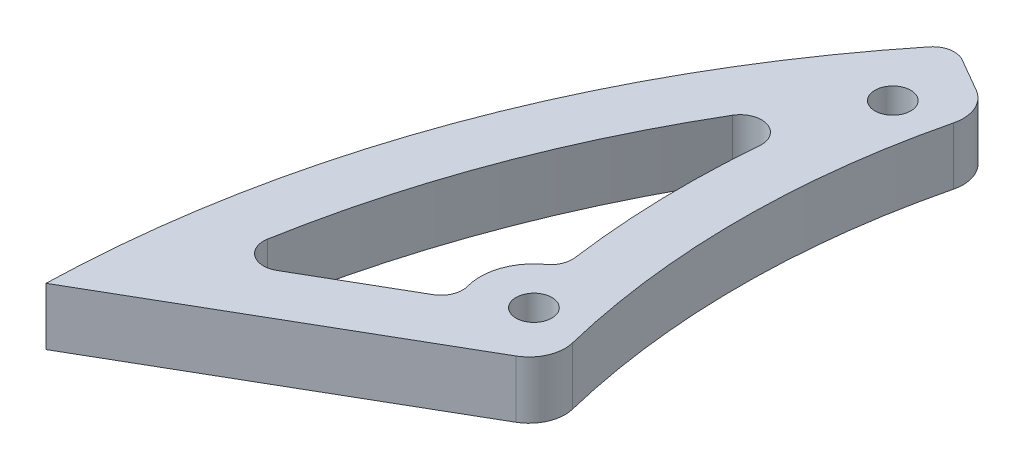
ISO-10303-21;
HEADER;
FILE_DESCRIPTION(('STEP AP214'),'2;1');
FILE_NAME('part.step','',(''),(''),'','','');
FILE_SCHEMA(('AUTOMOTIVE_DESIGN { 1 0 10303 214 1 1 1 1 }'));
ENDSEC;
DATA;
#1=APPLICATION_CONTEXT('core data for automotive mechanical design processes');
#2=APPLICATION_PROTOCOL_DEFINITION('international standard','automotive_design',2000,#1);
#3=PRODUCT_CONTEXT('',#1,'mechanical');
#4=PRODUCT('Part','Part','',(#3));
#5=PRODUCT_RELATED_PRODUCT_CATEGORY('part','',(#4));
#6=PRODUCT_DEFINITION_FORMATION('','',#4);
#7=PRODUCT_DEFINITION_CONTEXT('part definition',#1,'design');
#8=PRODUCT_DEFINITION('design','',#6,#7);
#9=PRODUCT_DEFINITION_SHAPE('','',#8);
#10=(LENGTH_UNIT() NAMED_UNIT(*) SI_UNIT(.MILLI.,.METRE.));
#11=(NAMED_UNIT(*) PLANE_ANGLE_UNIT() SI_UNIT($,.RADIAN.));
#12=(NAMED_UNIT(*) SI_UNIT($,.STERADIAN.) SOLID_ANGLE_UNIT());
#13=UNCERTAINTY_MEASURE_WITH_UNIT(LENGTH_MEASURE(1.E-05),#10,'distance_accuracy_value','');
#14=(GEOMETRIC_REPRESENTATION_CONTEXT(3) GLOBAL_UNCERTAINTY_ASSIGNED_CONTEXT((#13)) GLOBAL_UNIT_ASSIGNED_CONTEXT((#10,
#11,#12)) REPRESENTATION_CONTEXT('',''));
#15=CARTESIAN_POINT('',(0.,0.,0.));
#16=DIRECTION('',(0.,0.,1.));
#17=DIRECTION('',(1.,0.,0.));
#18=AXIS2_PLACEMENT_3D('',#15,#16,#17);
#19=CARTESIAN_POINT('',(0.,4.,0.));
#20=DIRECTION('',(0.,1.,0.));
#21=DIRECTION('',(0.,0.,1.));
#22=AXIS2_PLACEMENT_3D('',#19,#20,#21);
#23=PLANE('',#22);
#24=DIRECTION('',(-0.866025403784439,0.,-0.5));
#25=VECTOR('',#24,1.);
#26=CARTESIAN_POINT('',(-13.805005031535,4.,23.9109701133626));
#27=LINE('',#26,#25);
#28=CARTESIAN_POINT('',(-110.754014478588,4.,-32.0625665885613));
#29=VERTEX_POINT('',#28);
#30=CARTESIAN_POINT('',(-115.419321295632,4.,-34.7560827352334));
#31=VERTEX_POINT('',#30);
#32=EDGE_CURVE('E199',#29,#31,#27,.T.);
#33=ORIENTED_EDGE('',*,*,#32,.T.);
#34=CARTESIAN_POINT('',(-116.919321295632,4.,-32.1580065238801));
#35=DIRECTION('',(0.,1.,0.));
#36=DIRECTION('',(0.,0.,1.));
#37=AXIS2_PLACEMENT_3D('',#34,#35,#36);
#38=CIRCLE('',#37,3.);
#39=CARTESIAN_POINT('',(-119.258108415678,4.,-34.0368558544826));
#40=VERTEX_POINT('',#39);
#41=EDGE_CURVE('E297',#31,#40,#38,.T.);
#42=ORIENTED_EDGE('',*,*,#41,.T.);
#43=CARTESIAN_POINT('',(-2.31875241336388,4.,59.9056106756444));
#44=DIRECTION('',(0.,1.,0.));
#45=DIRECTION('',(0.,0.,1.));
#46=AXIS2_PLACEMENT_3D('',#43,#44,#45);
#47=CIRCLE('',#46,150.);
#48=CARTESIAN_POINT('',(-152.268704204241,4.,56.0310838769909));
#49=VERTEX_POINT('',#48);
#50=EDGE_CURVE('E204',#40,#49,#47,.T.);
#51=ORIENTED_EDGE('',*,*,#50,.T.);
#52=DIRECTION('',(-0.866025403784438,0.,0.500000000000002));
#53=VECTOR('',#52,1.);
#54=CARTESIAN_POINT('',(-13.8050050315352,4.,-23.9109701133628));
#55=LINE('',#54,#53);
#56=CARTESIAN_POINT('',(-110.754014478588,4.,32.0625665885613));
#57=VERTEX_POINT('',#56);
#58=EDGE_CURVE('E207',#57,#49,#55,.T.);
#59=ORIENTED_EDGE('',*,*,#58,.F.);
#60=CARTESIAN_POINT('',(-113.254014478588,4.,27.7324395696391));
#61=DIRECTION('',(0.,1.,0.));
#62=DIRECTION('',(0.,0.,1.));
#63=AXIS2_PLACEMENT_3D('',#60,#61,#62);
#64=CIRCLE('',#63,5.);
#65=CARTESIAN_POINT('',(-108.397495847431,4.,26.5432268951262));
#66=VERTEX_POINT('',#65);
#67=EDGE_CURVE('E280',#57,#66,#64,.T.);
#68=ORIENTED_EDGE('',*,*,#67,.T.);
#69=CARTESIAN_POINT('',(0.,4.,0.));
#70=DIRECTION('',(0.,1.,0.));
#71=DIRECTION('',(0.,0.,1.));
#72=AXIS2_PLACEMENT_3D('',#69,#70,#71);
#73=CIRCLE('',#72,111.6);
#74=CARTESIAN_POINT('',(-108.397495847431,4.,-26.5432268951262));
#75=VERTEX_POINT('',#74);
#76=EDGE_CURVE('E195',#75,#66,#73,.T.);
#77=ORIENTED_EDGE('',*,*,#76,.F.);
#78=CARTESIAN_POINT('',(-113.254014478588,4.,-27.7324395696391));
#79=DIRECTION('',(0.,1.,0.));
#80=DIRECTION('',(0.,0.,1.));
#81=AXIS2_PLACEMENT_3D('',#78,#79,#80);
#82=CIRCLE('',#81,5.);
#83=EDGE_CURVE('E277',#75,#29,#82,.T.);
#84=ORIENTED_EDGE('',*,*,#83,.T.);
#85=EDGE_LOOP('',(#33,#42,#51,#59,#68,#77,#84));
#86=FACE_BOUND('',#85,.T.);
#87=CARTESIAN_POINT('',(-115.321290315362,4.,25.));
#88=DIRECTION('',(0.,1.,0.));
#89=DIRECTION('',(0.,0.,1.));
#90=AXIS2_PLACEMENT_3D('',#87,#88,#89);
#91=CIRCLE('',#90,2.5);
#92=CARTESIAN_POINT('',(-115.321290315362,4.,27.5));
#93=VERTEX_POINT('',#92);
#94=EDGE_CURVE('E211',#93,#93,#91,.T.);
#95=ORIENTED_EDGE('',*,*,#94,.F.);
#96=EDGE_LOOP('',(#95));
#97=FACE_BOUND('',#96,.T.);
#98=CARTESIAN_POINT('',(-115.321290315362,4.,-25.));
#99=DIRECTION('',(0.,1.,0.));
#100=DIRECTION('',(0.,0.,1.));
#101=AXIS2_PLACEMENT_3D('',#98,#99,#100);
#102=CIRCLE('',#101,2.5);
#103=CARTESIAN_POINT('',(-115.321290315362,4.,-22.5));
#104=VERTEX_POINT('',#103);
#105=EDGE_CURVE('E215',#104,#104,#102,.T.);
#106=ORIENTED_EDGE('',*,*,#105,.F.);
#107=EDGE_LOOP('',(#106));
#108=FACE_BOUND('',#107,.T.);
#109=CARTESIAN_POINT('',(-2.31875241336388,4.,59.9056106756444));
#110=DIRECTION('',(0.,1.,0.));
#111=DIRECTION('',(0.,0.,1.));
#112=AXIS2_PLACEMENT_3D('',#109,#110,#111);
#113=CIRCLE('',#112,142.);
#114=CARTESIAN_POINT('',(-124.732425155548,4.,-12.0589134023306));
#115=VERTEX_POINT('',#114);
#116=CARTESIAN_POINT('',(-142.165402677388,4.,35.2699777442207));
#117=VERTEX_POINT('',#116);
#118=EDGE_CURVE('E182',#115,#117,#113,.T.);
#119=ORIENTED_EDGE('',*,*,#118,.F.);
#120=CARTESIAN_POINT('',(-122.14622080184,4.,-10.5385361330776));
#121=DIRECTION('',(0.,1.,0.));
#122=DIRECTION('',(0.,0.,1.));
#123=AXIS2_PLACEMENT_3D('',#120,#121,#122);
#124=CIRCLE('',#123,3.);
#125=CARTESIAN_POINT('',(-119.15732469739,4.,-10.2806600449925));
#126=VERTEX_POINT('',#125);
#127=EDGE_CURVE('E160',#115,#126,#124,.F.);
#128=ORIENTED_EDGE('',*,*,#127,.T.);
#129=CARTESIAN_POINT('',(0.,4.,0.));
#130=DIRECTION('',(0.,1.,0.));
#131=DIRECTION('',(0.,0.,1.));
#132=AXIS2_PLACEMENT_3D('',#129,#130,#131);
#133=CIRCLE('',#132,119.6);
#134=CARTESIAN_POINT('',(-118.511997397868,4.,16.0955420153478));
#135=VERTEX_POINT('',#134);
#136=EDGE_CURVE('E173',#126,#135,#133,.T.);
#137=ORIENTED_EDGE('',*,*,#136,.T.);
#138=CARTESIAN_POINT('',(-121.484706362697,4.,16.4992763468364));
#139=DIRECTION('',(0.,1.,0.));
#140=DIRECTION('',(0.,0.,1.));
#141=AXIS2_PLACEMENT_3D('',#138,#139,#140);
#142=CIRCLE('',#141,3.);
#143=CARTESIAN_POINT('',(-119.723730349173,4.,18.9280545334546));
#144=VERTEX_POINT('',#143);
#145=EDGE_CURVE('E56',#135,#144,#142,.F.);
#146=ORIENTED_EDGE('',*,*,#145,.T.);
#147=CARTESIAN_POINT('',(-115.321290315362,4.,25.));
#148=DIRECTION('',(0.,1.,0.));
#149=DIRECTION('',(0.,0.,1.));
#150=AXIS2_PLACEMENT_3D('',#147,#148,#149);
#151=CIRCLE('',#150,7.50000000000001);
#152=CARTESIAN_POINT('',(-122.542775640224,4.,27.0248826392678));
#153=VERTEX_POINT('',#152);
#154=EDGE_CURVE('E178',#144,#153,#151,.T.);
#155=ORIENTED_EDGE('',*,*,#154,.T.);
#156=CARTESIAN_POINT('',(-125.431369770168,4.,27.8348356949749));
#157=DIRECTION('',(0.,1.,0.));
#158=DIRECTION('',(0.,0.,1.));
#159=AXIS2_PLACEMENT_3D('',#156,#157,#158);
#160=CIRCLE('',#159,3.);
#161=CARTESIAN_POINT('',(-123.931369770168,4.,30.4329119063282));
#162=VERTEX_POINT('',#161);
#163=EDGE_CURVE('E63',#153,#162,#160,.F.);
#164=ORIENTED_EDGE('',*,*,#163,.T.);
#165=DIRECTION('',(0.866025403784438,0.,-0.500000000000001));
#166=VECTOR('',#165,1.);
#167=CARTESIAN_POINT('',(-17.8050050315352,4.,-30.8391733436383));
#168=LINE('',#167,#166);
#169=CARTESIAN_POINT('',(-137.710895981669,4.,38.3885250738435));
#170=VERTEX_POINT('',#169);
#171=EDGE_CURVE('E186',#170,#162,#168,.T.);
#172=ORIENTED_EDGE('',*,*,#171,.F.);
#173=CARTESIAN_POINT('',(-139.210895981669,4.,35.7904488624902));
#174=DIRECTION('',(0.,1.,0.));
#175=DIRECTION('',(0.,0.,1.));
#176=AXIS2_PLACEMENT_3D('',#173,#174,#175);
#177=CIRCLE('',#176,3.);
#178=EDGE_CURVE('E71',#170,#117,#177,.F.);
#179=ORIENTED_EDGE('',*,*,#178,.T.);
#180=EDGE_LOOP('',(#119,#128,#137,#146,#155,#164,#172,#179));
#181=FACE_BOUND('',#180,.T.);
#182=ADVANCED_FACE('F47',(#86,#97,#108,#181),#23,.T.);
#183=CARTESIAN_POINT('',(0.,-4.,0.));
#184=DIRECTION('',(0.,1.,0.));
#185=DIRECTION('',(0.,0.,1.));
#186=AXIS2_PLACEMENT_3D('',#183,#184,#185);
#187=PLANE('',#186);
#188=CARTESIAN_POINT('',(-115.321290315362,-4.,-25.));
#189=DIRECTION('',(0.,1.,0.));
#190=DIRECTION('',(0.,0.,1.));
#191=AXIS2_PLACEMENT_3D('',#188,#189,#190);
#192=CIRCLE('',#191,2.5);
#193=CARTESIAN_POINT('',(-115.321290315362,-4.,-22.5));
#194=VERTEX_POINT('',#193);
#195=EDGE_CURVE('E200',#194,#194,#192,.T.);
#196=ORIENTED_EDGE('',*,*,#195,.T.);
#197=EDGE_LOOP('',(#196));
#198=FACE_BOUND('',#197,.T.);
#199=CARTESIAN_POINT('',(-115.321290315362,-4.,25.));
#200=DIRECTION('',(0.,1.,0.));
#201=DIRECTION('',(0.,0.,1.));
#202=AXIS2_PLACEMENT_3D('',#199,#200,#201);
#203=CIRCLE('',#202,2.5);
#204=CARTESIAN_POINT('',(-115.321290315362,-4.,27.5));
#205=VERTEX_POINT('',#204);
#206=EDGE_CURVE('E234',#205,#205,#203,.T.);
#207=ORIENTED_EDGE('',*,*,#206,.T.);
#208=EDGE_LOOP('',(#207));
#209=FACE_BOUND('',#208,.T.);
#210=CARTESIAN_POINT('',(-2.31875241336388,-4.,59.9056106756444));
#211=DIRECTION('',(0.,1.,0.));
#212=DIRECTION('',(0.,0.,1.));
#213=AXIS2_PLACEMENT_3D('',#210,#211,#212);
#214=CIRCLE('',#213,150.);
#215=CARTESIAN_POINT('',(-119.258108415678,-4.,-34.0368558544826));
#216=VERTEX_POINT('',#215);
#217=CARTESIAN_POINT('',(-152.268704204241,-4.,56.0310838769909));
#218=VERTEX_POINT('',#217);
#219=EDGE_CURVE('E227',#216,#218,#214,.T.);
#220=ORIENTED_EDGE('',*,*,#219,.F.);
#221=CARTESIAN_POINT('',(-116.919321295632,-4.,-32.1580065238801));
#222=DIRECTION('',(0.,1.,0.));
#223=DIRECTION('',(0.,0.,1.));
#224=AXIS2_PLACEMENT_3D('',#221,#222,#223);
#225=CIRCLE('',#224,3.);
#226=CARTESIAN_POINT('',(-115.419321295632,-4.,-34.7560827352334));
#227=VERTEX_POINT('',#226);
#228=EDGE_CURVE('E291',#216,#227,#225,.F.);
#229=ORIENTED_EDGE('',*,*,#228,.T.);
#230=DIRECTION('',(-0.866025403784439,0.,-0.5));
#231=VECTOR('',#230,1.);
#232=CARTESIAN_POINT('',(-13.805005031535,-4.,23.9109701133626));
#233=LINE('',#232,#231);
#234=CARTESIAN_POINT('',(-110.754014478588,-4.,-32.0625665885613));
#235=VERTEX_POINT('',#234);
#236=EDGE_CURVE('E223',#235,#227,#233,.T.);
#237=ORIENTED_EDGE('',*,*,#236,.F.);
#238=CARTESIAN_POINT('',(-113.254014478588,-4.,-27.7324395696391));
#239=DIRECTION('',(0.,1.,0.));
#240=DIRECTION('',(0.,0.,1.));
#241=AXIS2_PLACEMENT_3D('',#238,#239,#240);
#242=CIRCLE('',#241,5.);
#243=CARTESIAN_POINT('',(-108.397495847431,-4.,-26.5432268951262));
#244=VERTEX_POINT('',#243);
#245=EDGE_CURVE('E268',#235,#244,#242,.F.);
#246=ORIENTED_EDGE('',*,*,#245,.T.);
#247=CARTESIAN_POINT('',(0.,-4.,0.));
#248=DIRECTION('',(0.,1.,0.));
#249=DIRECTION('',(0.,0.,1.));
#250=AXIS2_PLACEMENT_3D('',#247,#248,#249);
#251=CIRCLE('',#250,111.6);
#252=CARTESIAN_POINT('',(-108.397495847431,-4.,26.5432268951262));
#253=VERTEX_POINT('',#252);
#254=EDGE_CURVE('E168',#244,#253,#251,.T.);
#255=ORIENTED_EDGE('',*,*,#254,.T.);
#256=CARTESIAN_POINT('',(-113.254014478588,-4.,27.7324395696391));
#257=DIRECTION('',(0.,1.,0.));
#258=DIRECTION('',(0.,0.,1.));
#259=AXIS2_PLACEMENT_3D('',#256,#257,#258);
#260=CIRCLE('',#259,5.);
#261=CARTESIAN_POINT('',(-110.754014478588,-4.,32.0625665885613));
#262=VERTEX_POINT('',#261);
#263=EDGE_CURVE('E271',#253,#262,#260,.F.);
#264=ORIENTED_EDGE('',*,*,#263,.T.);
#265=DIRECTION('',(-0.866025403784438,0.,0.500000000000002));
#266=VECTOR('',#265,1.);
#267=CARTESIAN_POINT('',(-13.8050050315352,-4.,-23.9109701133628));
#268=LINE('',#267,#266);
#269=EDGE_CURVE('E230',#262,#218,#268,.T.);
#270=ORIENTED_EDGE('',*,*,#269,.T.);
#271=EDGE_LOOP('',(#220,#229,#237,#246,#255,#264,#270));
#272=FACE_BOUND('',#271,.T.);
#273=CARTESIAN_POINT('',(-122.14622080184,-4.,-10.5385361330776));
#274=DIRECTION('',(0.,1.,0.));
#275=DIRECTION('',(0.,0.,1.));
#276=AXIS2_PLACEMENT_3D('',#273,#274,#275);
#277=CIRCLE('',#276,3.);
#278=CARTESIAN_POINT('',(-124.732425155548,-4.,-12.0589134023306));
#279=VERTEX_POINT('',#278);
#280=CARTESIAN_POINT('',(-119.15732469739,-4.,-10.2806600449925));
#281=VERTEX_POINT('',#280);
#282=EDGE_CURVE('E163',#279,#281,#277,.F.);
#283=ORIENTED_EDGE('',*,*,#282,.F.);
#284=CARTESIAN_POINT('',(-2.31875241336388,-4.,59.9056106756444));
#285=DIRECTION('',(0.,1.,0.));
#286=DIRECTION('',(0.,0.,1.));
#287=AXIS2_PLACEMENT_3D('',#284,#285,#286);
#288=CIRCLE('',#287,142.);
#289=CARTESIAN_POINT('',(-142.165402677388,-4.,35.2699777442207));
#290=VERTEX_POINT('',#289);
#291=EDGE_CURVE('E244',#279,#290,#288,.T.);
#292=ORIENTED_EDGE('',*,*,#291,.T.);
#293=CARTESIAN_POINT('',(-139.210895981669,-4.,35.7904488624902));
#294=DIRECTION('',(0.,1.,0.));
#295=DIRECTION('',(0.,0.,1.));
#296=AXIS2_PLACEMENT_3D('',#293,#294,#295);
#297=CIRCLE('',#296,3.);
#298=CARTESIAN_POINT('',(-137.710895981669,-4.,38.3885250738435));
#299=VERTEX_POINT('',#298);
#300=EDGE_CURVE('E325',#290,#299,#297,.T.);
#301=ORIENTED_EDGE('',*,*,#300,.T.);
#302=DIRECTION('',(0.866025403784438,0.,-0.500000000000001));
#303=VECTOR('',#302,1.);
#304=CARTESIAN_POINT('',(-17.8050050315352,-4.,-30.8391733436383));
#305=LINE('',#304,#303);
#306=CARTESIAN_POINT('',(-123.931369770168,-4.,30.4329119063282));
#307=VERTEX_POINT('',#306);
#308=EDGE_CURVE('E248',#299,#307,#305,.T.);
#309=ORIENTED_EDGE('',*,*,#308,.T.);
#310=CARTESIAN_POINT('',(-125.431369770168,-4.,27.8348356949749));
#311=DIRECTION('',(0.,1.,0.));
#312=DIRECTION('',(0.,0.,1.));
#313=AXIS2_PLACEMENT_3D('',#310,#311,#312);
#314=CIRCLE('',#313,3.);
#315=CARTESIAN_POINT('',(-122.542775640224,-4.,27.0248826392678));
#316=VERTEX_POINT('',#315);
#317=EDGE_CURVE('E320',#307,#316,#314,.T.);
#318=ORIENTED_EDGE('',*,*,#317,.T.);
#319=CARTESIAN_POINT('',(-115.321290315362,-4.,25.));
#320=DIRECTION('',(0.,1.,0.));
#321=DIRECTION('',(0.,0.,1.));
#322=AXIS2_PLACEMENT_3D('',#319,#320,#321);
#323=CIRCLE('',#322,7.50000000000001);
#324=CARTESIAN_POINT('',(-119.723730349173,-4.,18.9280545334546));
#325=VERTEX_POINT('',#324);
#326=EDGE_CURVE('E252',#325,#316,#323,.T.);
#327=ORIENTED_EDGE('',*,*,#326,.F.);
#328=CARTESIAN_POINT('',(-121.484706362697,-4.,16.4992763468364));
#329=DIRECTION('',(0.,1.,0.));
#330=DIRECTION('',(0.,0.,1.));
#331=AXIS2_PLACEMENT_3D('',#328,#329,#330);
#332=CIRCLE('',#331,3.);
#333=CARTESIAN_POINT('',(-118.511997397868,-4.,16.0955420153478));
#334=VERTEX_POINT('',#333);
#335=EDGE_CURVE('E11',#325,#334,#332,.T.);
#336=ORIENTED_EDGE('',*,*,#335,.T.);
#337=CARTESIAN_POINT('',(0.,-4.,0.));
#338=DIRECTION('',(0.,1.,0.));
#339=DIRECTION('',(0.,0.,1.));
#340=AXIS2_PLACEMENT_3D('',#337,#338,#339);
#341=CIRCLE('',#340,119.6);
#342=EDGE_CURVE('E256',#281,#334,#341,.T.);
#343=ORIENTED_EDGE('',*,*,#342,.F.);
#344=EDGE_LOOP('',(#283,#292,#301,#309,#318,#327,#336,#343));
#345=FACE_BOUND('',#344,.T.);
#346=ADVANCED_FACE('F337',(#198,#209,#272,#345),#187,.F.);
#347=CARTESIAN_POINT('',(0.,4.,0.));
#348=DIRECTION('',(0.,-1.,0.));
#349=DIRECTION('',(0.,0.,-1.));
#350=AXIS2_PLACEMENT_3D('',#347,#348,#349);
#351=CYLINDRICAL_SURFACE('',#350,111.6);
#352=ORIENTED_EDGE('',*,*,#76,.T.);
#353=DIRECTION('',(0.,-1.,0.));
#354=VECTOR('',#353,1.);
#355=CARTESIAN_POINT('',(-108.397495847431,4.,26.5432268951262));
#356=LINE('',#355,#354);
#357=EDGE_CURVE('E264',#66,#253,#356,.T.);
#358=ORIENTED_EDGE('',*,*,#357,.T.);
#359=ORIENTED_EDGE('',*,*,#254,.F.);
#360=DIRECTION('',(0.,-1.,0.));
#361=VECTOR('',#360,1.);
#362=CARTESIAN_POINT('',(-108.397495847431,4.,-26.5432268951262));
#363=LINE('',#362,#361);
#364=EDGE_CURVE('E261',#244,#75,#363,.F.);
#365=ORIENTED_EDGE('',*,*,#364,.T.);
#366=EDGE_LOOP('',(#352,#358,#359,#365));
#367=FACE_BOUND('',#366,.T.);
#368=ADVANCED_FACE('F369',(#367),#351,.F.);
#369=CARTESIAN_POINT('',(-13.805005031535,4.,23.9109701133626));
#370=DIRECTION('',(-0.5,0.,0.866025403784439));
#371=DIRECTION('',(0.866025403784439,0.,0.5));
#372=AXIS2_PLACEMENT_3D('',#369,#370,#371);
#373=PLANE('',#372);
#374=ORIENTED_EDGE('',*,*,#236,.T.);
#375=DIRECTION('',(0.,-1.,0.));
#376=VECTOR('',#375,1.);
#377=CARTESIAN_POINT('',(-115.419321295632,4.,-34.7560827352334));
#378=LINE('',#377,#376);
#379=EDGE_CURVE('E294',#227,#31,#378,.F.);
#380=ORIENTED_EDGE('',*,*,#379,.T.);
#381=ORIENTED_EDGE('',*,*,#32,.F.);
#382=DIRECTION('',(0.,1.,0.));
#383=VECTOR('',#382,1.);
#384=CARTESIAN_POINT('',(-110.754014478588,-4.,-32.0625665885613));
#385=LINE('',#384,#383);
#386=EDGE_CURVE('E283',#29,#235,#385,.F.);
#387=ORIENTED_EDGE('',*,*,#386,.T.);
#388=EDGE_LOOP('',(#374,#380,#381,#387));
#389=FACE_BOUND('',#388,.T.);
#390=ADVANCED_FACE('F389',(#389),#373,.F.);
#391=CARTESIAN_POINT('',(-2.31875241336388,4.,59.9056106756444));
#392=DIRECTION('',(0.,-1.,0.));
#393=DIRECTION('',(0.,0.,-1.));
#394=AXIS2_PLACEMENT_3D('',#391,#392,#393);
#395=CYLINDRICAL_SURFACE('',#394,150.);
#396=ORIENTED_EDGE('',*,*,#50,.F.);
#397=DIRECTION('',(0.,-1.,0.));
#398=VECTOR('',#397,1.);
#399=CARTESIAN_POINT('',(-119.258108415678,4.,-34.0368558544826));
#400=LINE('',#399,#398);
#401=EDGE_CURVE('E287',#40,#216,#400,.T.);
#402=ORIENTED_EDGE('',*,*,#401,.T.);
#403=ORIENTED_EDGE('',*,*,#219,.T.);
#404=DIRECTION('',(0.,-1.,0.));
#405=VECTOR('',#404,1.);
#406=CARTESIAN_POINT('',(-152.268704204241,4.,56.0310838769909));
#407=LINE('',#406,#405);
#408=EDGE_CURVE('E219',#49,#218,#407,.T.);
#409=ORIENTED_EDGE('',*,*,#408,.F.);
#410=EDGE_LOOP('',(#396,#402,#403,#409));
#411=FACE_BOUND('',#410,.T.);
#412=ADVANCED_FACE('F382',(#411),#395,.T.);
#413=CARTESIAN_POINT('',(-115.321290315362,4.,25.));
#414=DIRECTION('',(0.,-1.,0.));
#415=DIRECTION('',(0.,0.,-1.));
#416=AXIS2_PLACEMENT_3D('',#413,#414,#415);
#417=CYLINDRICAL_SURFACE('',#416,2.5);
#418=ORIENTED_EDGE('',*,*,#94,.T.);
#419=EDGE_LOOP('',(#418));
#420=FACE_BOUND('',#419,.T.);
#421=ORIENTED_EDGE('',*,*,#206,.F.);
#422=EDGE_LOOP('',(#421));
#423=FACE_BOUND('',#422,.T.);
#424=ADVANCED_FACE('F379',(#420,#423),#417,.F.);
#425=CARTESIAN_POINT('',(-13.8050050315352,4.,-23.9109701133628));
#426=DIRECTION('',(0.500000000000002,0.,0.866025403784438));
#427=DIRECTION('',(0.866025403784438,0.,-0.500000000000002));
#428=AXIS2_PLACEMENT_3D('',#425,#426,#427);
#429=PLANE('',#428);
#430=ORIENTED_EDGE('',*,*,#269,.F.);
#431=DIRECTION('',(0.,-1.,0.));
#432=VECTOR('',#431,1.);
#433=CARTESIAN_POINT('',(-110.754014478588,4.,32.0625665885613));
#434=LINE('',#433,#432);
#435=EDGE_CURVE('E274',#262,#57,#434,.F.);
#436=ORIENTED_EDGE('',*,*,#435,.T.);
#437=ORIENTED_EDGE('',*,*,#58,.T.);
#438=ORIENTED_EDGE('',*,*,#408,.T.);
#439=EDGE_LOOP('',(#430,#436,#437,#438));
#440=FACE_BOUND('',#439,.T.);
#441=ADVANCED_FACE('F377',(#440),#429,.T.);
#442=CARTESIAN_POINT('',(-115.321290315362,4.,-25.));
#443=DIRECTION('',(0.,-1.,0.));
#444=DIRECTION('',(0.,0.,-1.));
#445=AXIS2_PLACEMENT_3D('',#442,#443,#444);
#446=CYLINDRICAL_SURFACE('',#445,2.5);
#447=ORIENTED_EDGE('',*,*,#105,.T.);
#448=EDGE_LOOP('',(#447));
#449=FACE_BOUND('',#448,.T.);
#450=ORIENTED_EDGE('',*,*,#195,.F.);
#451=EDGE_LOOP('',(#450));
#452=FACE_BOUND('',#451,.T.);
#453=ADVANCED_FACE('F374',(#449,#452),#446,.F.);
#454=CARTESIAN_POINT('',(-122.14622080184,-17.,-10.5385361330776));
#455=DIRECTION('',(0.,1.,0.));
#456=DIRECTION('',(0.,0.,1.));
#457=AXIS2_PLACEMENT_3D('',#454,#455,#456);
#458=CYLINDRICAL_SURFACE('',#457,3.);
#459=ORIENTED_EDGE('',*,*,#282,.T.);
#460=DIRECTION('',(0.,1.,0.));
#461=VECTOR('',#460,1.);
#462=CARTESIAN_POINT('',(-119.15732469739,-17.,-10.2806600449925));
#463=LINE('',#462,#461);
#464=EDGE_CURVE('E155',#281,#126,#463,.T.);
#465=ORIENTED_EDGE('',*,*,#464,.T.);
#466=ORIENTED_EDGE('',*,*,#127,.F.);
#467=DIRECTION('',(0.,1.,0.));
#468=VECTOR('',#467,1.);
#469=CARTESIAN_POINT('',(-124.732425155548,-17.,-12.0589134023306));
#470=LINE('',#469,#468);
#471=EDGE_CURVE('E169',#279,#115,#470,.T.);
#472=ORIENTED_EDGE('',*,*,#471,.F.);
#473=EDGE_LOOP('',(#459,#465,#466,#472));
#474=FACE_BOUND('',#473,.T.);
#475=ADVANCED_FACE('F157',(#474),#458,.F.);
#476=CARTESIAN_POINT('',(0.,-17.,0.));
#477=DIRECTION('',(0.,1.,0.));
#478=DIRECTION('',(0.,0.,1.));
#479=AXIS2_PLACEMENT_3D('',#476,#477,#478);
#480=CYLINDRICAL_SURFACE('',#479,119.6);
#481=ORIENTED_EDGE('',*,*,#342,.T.);
#482=DIRECTION('',(0.,1.,0.));
#483=VECTOR('',#482,1.);
#484=CARTESIAN_POINT('',(-118.511997397868,-17.,16.0955420153478));
#485=LINE('',#484,#483);
#486=EDGE_CURVE('E176',#334,#135,#485,.T.);
#487=ORIENTED_EDGE('',*,*,#486,.T.);
#488=ORIENTED_EDGE('',*,*,#136,.F.);
#489=ORIENTED_EDGE('',*,*,#464,.F.);
#490=EDGE_LOOP('',(#481,#487,#488,#489));
#491=FACE_BOUND('',#490,.T.);
#492=ADVANCED_FACE('F174',(#491),#480,.T.);
#493=CARTESIAN_POINT('',(-115.321290315362,-17.,25.));
#494=DIRECTION('',(0.,1.,0.));
#495=DIRECTION('',(0.,0.,1.));
#496=AXIS2_PLACEMENT_3D('',#493,#494,#495);
#497=CYLINDRICAL_SURFACE('',#496,7.50000000000001);
#498=ORIENTED_EDGE('',*,*,#326,.T.);
#499=DIRECTION('',(0.,1.,0.));
#500=VECTOR('',#499,1.);
#501=CARTESIAN_POINT('',(-122.542775640224,-17.,27.0248826392678));
#502=LINE('',#501,#500);
#503=EDGE_CURVE('E303',#316,#153,#502,.T.);
#504=ORIENTED_EDGE('',*,*,#503,.T.);
#505=ORIENTED_EDGE('',*,*,#154,.F.);
#506=DIRECTION('',(0.,1.,0.));
#507=VECTOR('',#506,1.);
#508=CARTESIAN_POINT('',(-119.723730349173,-17.,18.9280545334546));
#509=LINE('',#508,#507);
#510=EDGE_CURVE('E300',#144,#325,#509,.F.);
#511=ORIENTED_EDGE('',*,*,#510,.T.);
#512=EDGE_LOOP('',(#498,#504,#505,#511));
#513=FACE_BOUND('',#512,.T.);
#514=ADVANCED_FACE('F332',(#513),#497,.T.);
#515=CARTESIAN_POINT('',(-17.8050050315352,-17.,-30.8391733436383));
#516=DIRECTION('',(0.500000000000001,0.,0.866025403784438));
#517=DIRECTION('',(0.866025403784438,0.,-0.500000000000001));
#518=AXIS2_PLACEMENT_3D('',#515,#516,#517);
#519=PLANE('',#518);
#520=ORIENTED_EDGE('',*,*,#171,.T.);
#521=DIRECTION('',(0.,1.,0.));
#522=VECTOR('',#521,1.);
#523=CARTESIAN_POINT('',(-123.931369770168,-17.,30.4329119063282));
#524=LINE('',#523,#522);
#525=EDGE_CURVE('E310',#162,#307,#524,.F.);
#526=ORIENTED_EDGE('',*,*,#525,.T.);
#527=ORIENTED_EDGE('',*,*,#308,.F.);
#528=DIRECTION('',(0.,-1.,0.));
#529=VECTOR('',#528,1.);
#530=CARTESIAN_POINT('',(-137.710895981669,3.99999999999999,38.3885250738435));
#531=LINE('',#530,#529);
#532=EDGE_CURVE('E307',#299,#170,#531,.F.);
#533=ORIENTED_EDGE('',*,*,#532,.T.);
#534=EDGE_LOOP('',(#520,#526,#527,#533));
#535=FACE_BOUND('',#534,.T.);
#536=ADVANCED_FACE('F344',(#535),#519,.F.);
#537=CARTESIAN_POINT('',(-2.31875241336388,-17.,59.9056106756444));
#538=DIRECTION('',(0.,1.,0.));
#539=DIRECTION('',(0.,0.,1.));
#540=AXIS2_PLACEMENT_3D('',#537,#538,#539);
#541=CYLINDRICAL_SURFACE('',#540,142.);
#542=ORIENTED_EDGE('',*,*,#118,.T.);
#543=DIRECTION('',(0.,1.,0.));
#544=VECTOR('',#543,1.);
#545=CARTESIAN_POINT('',(-142.165402677388,-17.,35.2699777442207));
#546=LINE('',#545,#544);
#547=EDGE_CURVE('E313',#117,#290,#546,.F.);
#548=ORIENTED_EDGE('',*,*,#547,.T.);
#549=ORIENTED_EDGE('',*,*,#291,.F.);
#550=ORIENTED_EDGE('',*,*,#471,.T.);
#551=EDGE_LOOP('',(#542,#548,#549,#550));
#552=FACE_BOUND('',#551,.T.);
#553=ADVANCED_FACE('F348',(#552),#541,.F.);
#554=CARTESIAN_POINT('',(-113.254014478588,4.,27.7324395696391));
#555=DIRECTION('',(0.,-1.,0.));
#556=DIRECTION('',(0.,0.,-1.));
#557=AXIS2_PLACEMENT_3D('',#554,#555,#556);
#558=CYLINDRICAL_SURFACE('',#557,5.);
#559=ORIENTED_EDGE('',*,*,#67,.F.);
#560=ORIENTED_EDGE('',*,*,#435,.F.);
#561=ORIENTED_EDGE('',*,*,#263,.F.);
#562=ORIENTED_EDGE('',*,*,#357,.F.);
#563=EDGE_LOOP('',(#559,#560,#561,#562));
#564=FACE_BOUND('',#563,.T.);
#565=ADVANCED_FACE('F350',(#564),#558,.T.);
#566=CARTESIAN_POINT('',(-113.254014478588,4.,-27.7324395696391));
#567=DIRECTION('',(0.,-1.,0.));
#568=DIRECTION('',(0.,0.,-1.));
#569=AXIS2_PLACEMENT_3D('',#566,#567,#568);
#570=CYLINDRICAL_SURFACE('',#569,5.);
#571=ORIENTED_EDGE('',*,*,#83,.F.);
#572=ORIENTED_EDGE('',*,*,#364,.F.);
#573=ORIENTED_EDGE('',*,*,#245,.F.);
#574=ORIENTED_EDGE('',*,*,#386,.F.);
#575=EDGE_LOOP('',(#571,#572,#573,#574));
#576=FACE_BOUND('',#575,.T.);
#577=ADVANCED_FACE('F357',(#576),#570,.T.);
#578=CARTESIAN_POINT('',(-116.919321295632,4.,-32.1580065238801));
#579=DIRECTION('',(0.,-1.,0.));
#580=DIRECTION('',(0.,0.,-1.));
#581=AXIS2_PLACEMENT_3D('',#578,#579,#580);
#582=CYLINDRICAL_SURFACE('',#581,3.);
#583=ORIENTED_EDGE('',*,*,#41,.F.);
#584=ORIENTED_EDGE('',*,*,#379,.F.);
#585=ORIENTED_EDGE('',*,*,#228,.F.);
#586=ORIENTED_EDGE('',*,*,#401,.F.);
#587=EDGE_LOOP('',(#583,#584,#585,#586));
#588=FACE_BOUND('',#587,.T.);
#589=ADVANCED_FACE('F399',(#588),#582,.T.);
#590=CARTESIAN_POINT('',(-125.431369770168,-17.,27.8348356949749));
#591=DIRECTION('',(0.,1.,0.));
#592=DIRECTION('',(0.,0.,1.));
#593=AXIS2_PLACEMENT_3D('',#590,#591,#592);
#594=CYLINDRICAL_SURFACE('',#593,3.);
#595=ORIENTED_EDGE('',*,*,#317,.F.);
#596=ORIENTED_EDGE('',*,*,#525,.F.);
#597=ORIENTED_EDGE('',*,*,#163,.F.);
#598=ORIENTED_EDGE('',*,*,#503,.F.);
#599=EDGE_LOOP('',(#595,#596,#597,#598));
#600=FACE_BOUND('',#599,.T.);
#601=ADVANCED_FACE('F340',(#600),#594,.F.);
#602=CARTESIAN_POINT('',(-139.210895981669,-17.,35.7904488624902));
#603=DIRECTION('',(0.,1.,0.));
#604=DIRECTION('',(0.,0.,1.));
#605=AXIS2_PLACEMENT_3D('',#602,#603,#604);
#606=CYLINDRICAL_SURFACE('',#605,3.);
#607=ORIENTED_EDGE('',*,*,#300,.F.);
#608=ORIENTED_EDGE('',*,*,#547,.F.);
#609=ORIENTED_EDGE('',*,*,#178,.F.);
#610=ORIENTED_EDGE('',*,*,#532,.F.);
#611=EDGE_LOOP('',(#607,#608,#609,#610));
#612=FACE_BOUND('',#611,.T.);
#613=ADVANCED_FACE('F346',(#612),#606,.F.);
#614=CARTESIAN_POINT('',(-121.484706362697,-17.,16.4992763468364));
#615=DIRECTION('',(0.,-1.,0.));
#616=DIRECTION('',(0.,0.,-1.));
#617=AXIS2_PLACEMENT_3D('',#614,#615,#616);
#618=CYLINDRICAL_SURFACE('',#617,3.);
#619=ORIENTED_EDGE('',*,*,#335,.F.);
#620=ORIENTED_EDGE('',*,*,#510,.F.);
#621=ORIENTED_EDGE('',*,*,#145,.F.);
#622=ORIENTED_EDGE('',*,*,#486,.F.);
#623=EDGE_LOOP('',(#619,#620,#621,#622));
#624=FACE_BOUND('',#623,.T.);
#625=ADVANCED_FACE('F49',(#624),#618,.F.);
#626=CLOSED_SHELL('',(#182,#346,#368,#390,#412,#424,#441,#453,#475,#492,#514,#536,#553,#565,
#577,#589,#601,#613,#625));
#627=MANIFOLD_SOLID_BREP('B2',#626);
#628=ADVANCED_BREP_SHAPE_REPRESENTATION('',(#18,#627),#14);
#629=SHAPE_DEFINITION_REPRESENTATION(#9,#628);
ENDSEC;
END-ISO-10303-21;
